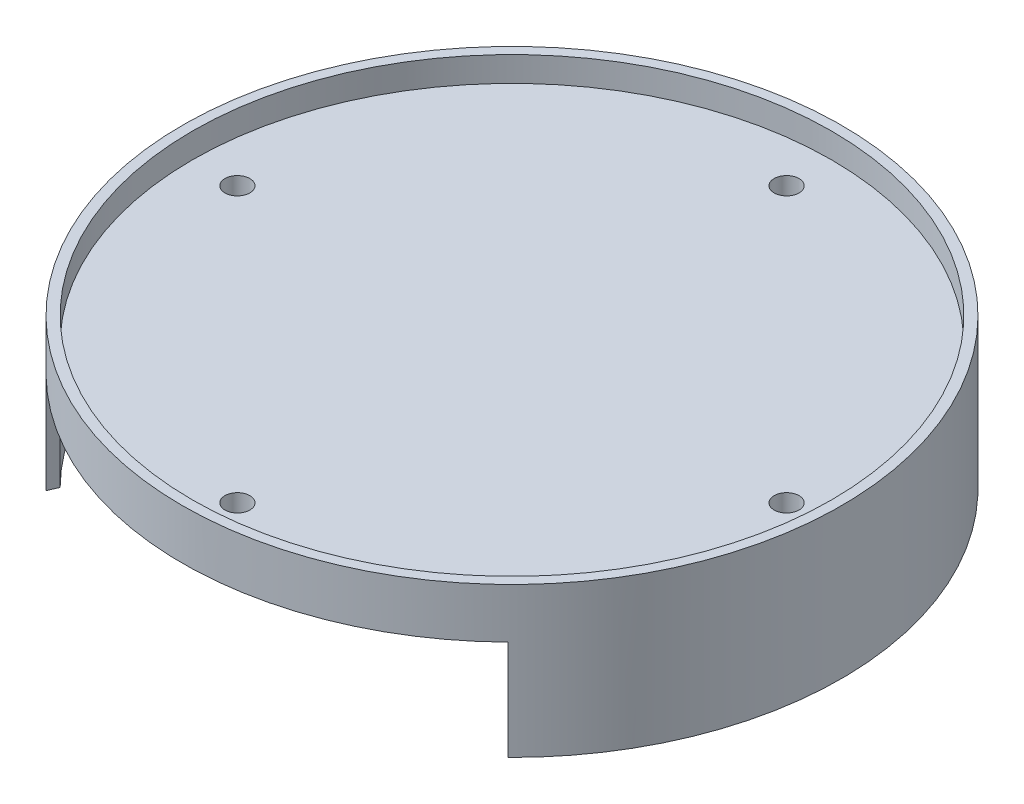
ISO-10303-21;
HEADER;
FILE_DESCRIPTION(('STEP AP214'),'2;1');
FILE_NAME('part.step','',(''),(''),'','','');
FILE_SCHEMA(('AUTOMOTIVE_DESIGN { 1 0 10303 214 1 1 1 1 }'));
ENDSEC;
DATA;
#1=APPLICATION_CONTEXT('core data for automotive mechanical design processes');
#2=APPLICATION_PROTOCOL_DEFINITION('international standard','automotive_design',2000,#1);
#3=PRODUCT_CONTEXT('',#1,'mechanical');
#4=PRODUCT('Part','Part','',(#3));
#5=PRODUCT_RELATED_PRODUCT_CATEGORY('part','',(#4));
#6=PRODUCT_DEFINITION_FORMATION('','',#4);
#7=PRODUCT_DEFINITION_CONTEXT('part definition',#1,'design');
#8=PRODUCT_DEFINITION('design','',#6,#7);
#9=PRODUCT_DEFINITION_SHAPE('','',#8);
#10=(LENGTH_UNIT() NAMED_UNIT(*) SI_UNIT(.MILLI.,.METRE.));
#11=(NAMED_UNIT(*) PLANE_ANGLE_UNIT() SI_UNIT($,.RADIAN.));
#12=(NAMED_UNIT(*) SI_UNIT($,.STERADIAN.) SOLID_ANGLE_UNIT());
#13=UNCERTAINTY_MEASURE_WITH_UNIT(LENGTH_MEASURE(1.E-05),#10,'distance_accuracy_value','');
#14=(GEOMETRIC_REPRESENTATION_CONTEXT(3) GLOBAL_UNCERTAINTY_ASSIGNED_CONTEXT((#13)) GLOBAL_UNIT_ASSIGNED_CONTEXT((#10,
#11,#12)) REPRESENTATION_CONTEXT('',''));
#15=CARTESIAN_POINT('',(0.,0.,0.));
#16=DIRECTION('',(0.,0.,1.));
#17=DIRECTION('',(1.,0.,0.));
#18=AXIS2_PLACEMENT_3D('',#15,#16,#17);
#19=CARTESIAN_POINT('',(0.,12.5,0.));
#20=DIRECTION('',(0.,1.,0.));
#21=DIRECTION('',(0.,0.,1.));
#22=AXIS2_PLACEMENT_3D('',#19,#20,#21);
#23=PLANE('',#22);
#24=CARTESIAN_POINT('',(-27.4999999999992,12.5,7.79913119987283E-13));
#25=DIRECTION('',(0.,1.,0.));
#26=DIRECTION('',(0.,0.,1.));
#27=AXIS2_PLACEMENT_3D('',#24,#25,#26);
#28=CIRCLE('',#27,1.25000000000125);
#29=CARTESIAN_POINT('',(-27.4999999999992,12.5,1.25000000000203));
#30=VERTEX_POINT('',#29);
#31=EDGE_CURVE('E118',#30,#30,#28,.T.);
#32=ORIENTED_EDGE('',*,*,#31,.F.);
#33=EDGE_LOOP('',(#32));
#34=FACE_BOUND('',#33,.T.);
#35=CARTESIAN_POINT('',(27.5,12.5,0.));
#36=DIRECTION('',(0.,1.,0.));
#37=DIRECTION('',(0.,0.,1.));
#38=AXIS2_PLACEMENT_3D('',#35,#36,#37);
#39=CIRCLE('',#38,1.25);
#40=CARTESIAN_POINT('',(27.5,12.5,1.2500000000001));
#41=VERTEX_POINT('',#40);
#42=EDGE_CURVE('E124',#41,#41,#39,.T.);
#43=ORIENTED_EDGE('',*,*,#42,.F.);
#44=EDGE_LOOP('',(#43));
#45=FACE_BOUND('',#44,.T.);
#46=CARTESIAN_POINT('',(0.,12.5,-27.5));
#47=DIRECTION('',(0.,1.,0.));
#48=DIRECTION('',(0.,0.,1.));
#49=AXIS2_PLACEMENT_3D('',#46,#47,#48);
#50=CIRCLE('',#49,1.25);
#51=CARTESIAN_POINT('',(0.,12.5,-26.25));
#52=VERTEX_POINT('',#51);
#53=EDGE_CURVE('E127',#52,#52,#50,.T.);
#54=ORIENTED_EDGE('',*,*,#53,.F.);
#55=EDGE_LOOP('',(#54));
#56=FACE_BOUND('',#55,.T.);
#57=CARTESIAN_POINT('',(1.55309068257925E-12,12.5,27.5));
#58=DIRECTION('',(0.,1.,0.));
#59=DIRECTION('',(0.,0.,1.));
#60=AXIS2_PLACEMENT_3D('',#57,#58,#59);
#61=CIRCLE('',#60,1.25000000000167);
#62=CARTESIAN_POINT('',(1.55309068257925E-12,12.5,28.7500000000017));
#63=VERTEX_POINT('',#62);
#64=EDGE_CURVE('E121',#63,#63,#61,.T.);
#65=ORIENTED_EDGE('',*,*,#64,.F.);
#66=EDGE_LOOP('',(#65));
#67=FACE_BOUND('',#66,.T.);
#68=CARTESIAN_POINT('',(0.,12.5,0.));
#69=DIRECTION('',(0.,1.,0.));
#70=DIRECTION('',(0.,0.,1.));
#71=AXIS2_PLACEMENT_3D('',#68,#69,#70);
#72=CIRCLE('',#71,32.);
#73=CARTESIAN_POINT('',(0.,12.5,32.));
#74=VERTEX_POINT('',#73);
#75=EDGE_CURVE('E11',#74,#74,#72,.F.);
#76=ORIENTED_EDGE('',*,*,#75,.F.);
#77=EDGE_LOOP('',(#76));
#78=FACE_BOUND('',#77,.T.);
#79=ADVANCED_FACE('F39',(#34,#45,#56,#67,#78),#23,.T.);
#80=CARTESIAN_POINT('',(0.,0.,0.));
#81=DIRECTION('',(0.,1.,0.));
#82=DIRECTION('',(0.,0.,1.));
#83=AXIS2_PLACEMENT_3D('',#80,#81,#82);
#84=PLANE('',#83);
#85=CARTESIAN_POINT('',(0.,0.,0.));
#86=DIRECTION('',(0.,1.,0.));
#87=DIRECTION('',(0.,0.,1.));
#88=AXIS2_PLACEMENT_3D('',#85,#86,#87);
#89=CIRCLE('',#88,33.);
#90=CARTESIAN_POINT('',(23.1370879607204,0.,23.530303030303));
#91=VERTEX_POINT('',#90);
#92=CARTESIAN_POINT('',(-23.1370879607204,0.,23.530303030303));
#93=VERTEX_POINT('',#92);
#94=EDGE_CURVE('E48',#91,#93,#89,.T.);
#95=ORIENTED_EDGE('',*,*,#94,.F.);
#96=CARTESIAN_POINT('',(0.,0.,33.));
#97=DIRECTION('',(0.,-1.,0.));
#98=DIRECTION('',(0.,0.,-1.));
#99=AXIS2_PLACEMENT_3D('',#96,#97,#98);
#100=CIRCLE('',#99,25.);
#101=CARTESIAN_POINT('',(22.7090836305396,0.,22.5454545454545));
#102=VERTEX_POINT('',#101);
#103=EDGE_CURVE('E99',#102,#91,#100,.T.);
#104=ORIENTED_EDGE('',*,*,#103,.F.);
#105=CARTESIAN_POINT('',(0.,0.,0.));
#106=DIRECTION('',(0.,1.,0.));
#107=DIRECTION('',(0.,0.,1.));
#108=AXIS2_PLACEMENT_3D('',#105,#106,#107);
#109=CIRCLE('',#108,32.);
#110=CARTESIAN_POINT('',(-22.7090836305396,0.,22.5454545454545));
#111=VERTEX_POINT('',#110);
#112=EDGE_CURVE('E97',#102,#111,#109,.T.);
#113=ORIENTED_EDGE('',*,*,#112,.T.);
#114=EDGE_CURVE('E63',#93,#111,#100,.T.);
#115=ORIENTED_EDGE('',*,*,#114,.F.);
#116=EDGE_LOOP('',(#95,#104,#113,#115));
#117=FACE_BOUND('',#116,.T.);
#118=ADVANCED_FACE('F136',(#117),#84,.F.);
#119=CARTESIAN_POINT('',(0.,12.5,0.));
#120=DIRECTION('',(0.,-1.,0.));
#121=DIRECTION('',(0.,0.,-1.));
#122=AXIS2_PLACEMENT_3D('',#119,#120,#121);
#123=CYLINDRICAL_SURFACE('',#122,33.);
#124=ORIENTED_EDGE('',*,*,#94,.T.);
#125=DIRECTION('',(0.,-1.,0.));
#126=VECTOR('',#125,1.);
#127=CARTESIAN_POINT('',(-23.1370879607204,5.,23.530303030303));
#128=LINE('',#127,#126);
#129=CARTESIAN_POINT('',(-23.1370879607204,10.,23.530303030303));
#130=VERTEX_POINT('',#129);
#131=EDGE_CURVE('E134',#93,#130,#128,.F.);
#132=ORIENTED_EDGE('',*,*,#131,.T.);
#133=CARTESIAN_POINT('',(0.,10.,0.));
#134=DIRECTION('',(0.,-1.,0.));
#135=DIRECTION('',(0.,0.,-1.));
#136=AXIS2_PLACEMENT_3D('',#133,#134,#135);
#137=CIRCLE('',#136,33.);
#138=CARTESIAN_POINT('',(23.1370879607204,10.,23.530303030303));
#139=VERTEX_POINT('',#138);
#140=EDGE_CURVE('E142',#139,#130,#137,.T.);
#141=ORIENTED_EDGE('',*,*,#140,.F.);
#142=DIRECTION('',(0.,-1.,0.));
#143=VECTOR('',#142,1.);
#144=CARTESIAN_POINT('',(23.1370879607204,5.,23.530303030303));
#145=LINE('',#144,#143);
#146=EDGE_CURVE('E88',#139,#91,#145,.T.);
#147=ORIENTED_EDGE('',*,*,#146,.T.);
#148=EDGE_LOOP('',(#124,#132,#141,#147));
#149=FACE_BOUND('',#148,.T.);
#150=CARTESIAN_POINT('',(0.,15.,0.));
#151=DIRECTION('',(0.,1.,0.));
#152=DIRECTION('',(0.,0.,1.));
#153=AXIS2_PLACEMENT_3D('',#150,#151,#152);
#154=CIRCLE('',#153,33.);
#155=CARTESIAN_POINT('',(0.,15.,33.));
#156=VERTEX_POINT('',#155);
#157=EDGE_CURVE('E106',#156,#156,#154,.T.);
#158=ORIENTED_EDGE('',*,*,#157,.F.);
#159=EDGE_LOOP('',(#158));
#160=FACE_BOUND('',#159,.T.);
#161=ADVANCED_FACE('F41',(#149,#160),#123,.T.);
#162=CARTESIAN_POINT('',(0.,12.5,-27.5));
#163=DIRECTION('',(0.,-1.,0.));
#164=DIRECTION('',(0.,0.,-1.));
#165=AXIS2_PLACEMENT_3D('',#162,#163,#164);
#166=CYLINDRICAL_SURFACE('',#165,1.25);
#167=CARTESIAN_POINT('',(0.,10.,-27.5));
#168=DIRECTION('',(0.,1.,0.));
#169=DIRECTION('',(0.,0.,1.));
#170=AXIS2_PLACEMENT_3D('',#167,#168,#169);
#171=CIRCLE('',#170,1.25);
#172=CARTESIAN_POINT('',(0.,10.,-26.25));
#173=VERTEX_POINT('',#172);
#174=EDGE_CURVE('E115',#173,#173,#171,.T.);
#175=ORIENTED_EDGE('',*,*,#174,.F.);
#176=EDGE_LOOP('',(#175));
#177=FACE_BOUND('',#176,.T.);
#178=ORIENTED_EDGE('',*,*,#53,.T.);
#179=EDGE_LOOP('',(#178));
#180=FACE_BOUND('',#179,.T.);
#181=ADVANCED_FACE('F152',(#177,#180),#166,.F.);
#182=CARTESIAN_POINT('',(27.5,12.5,0.));
#183=DIRECTION('',(0.,-1.,0.));
#184=DIRECTION('',(0.,0.,-1.));
#185=AXIS2_PLACEMENT_3D('',#182,#183,#184);
#186=CYLINDRICAL_SURFACE('',#185,1.25);
#187=CARTESIAN_POINT('',(27.5,10.,0.));
#188=DIRECTION('',(0.,1.,0.));
#189=DIRECTION('',(0.,0.,1.));
#190=AXIS2_PLACEMENT_3D('',#187,#188,#189);
#191=CIRCLE('',#190,1.25);
#192=CARTESIAN_POINT('',(27.5,10.,1.2500000000001));
#193=VERTEX_POINT('',#192);
#194=EDGE_CURVE('E112',#193,#193,#191,.T.);
#195=ORIENTED_EDGE('',*,*,#194,.F.);
#196=EDGE_LOOP('',(#195));
#197=FACE_BOUND('',#196,.T.);
#198=ORIENTED_EDGE('',*,*,#42,.T.);
#199=EDGE_LOOP('',(#198));
#200=FACE_BOUND('',#199,.T.);
#201=ADVANCED_FACE('F157',(#197,#200),#186,.F.);
#202=CARTESIAN_POINT('',(1.55309068257925E-12,12.5,27.5));
#203=DIRECTION('',(0.,-1.,0.));
#204=DIRECTION('',(0.,0.,-1.));
#205=AXIS2_PLACEMENT_3D('',#202,#203,#204);
#206=CYLINDRICAL_SURFACE('',#205,1.25000000000167);
#207=CARTESIAN_POINT('',(1.55309068257925E-12,10.,27.5));
#208=DIRECTION('',(0.,1.,0.));
#209=DIRECTION('',(0.,0.,1.));
#210=AXIS2_PLACEMENT_3D('',#207,#208,#209);
#211=CIRCLE('',#210,1.25000000000167);
#212=CARTESIAN_POINT('',(1.55309068257925E-12,10.,28.7500000000017));
#213=VERTEX_POINT('',#212);
#214=EDGE_CURVE('E105',#213,#213,#211,.T.);
#215=ORIENTED_EDGE('',*,*,#214,.F.);
#216=EDGE_LOOP('',(#215));
#217=FACE_BOUND('',#216,.T.);
#218=ORIENTED_EDGE('',*,*,#64,.T.);
#219=EDGE_LOOP('',(#218));
#220=FACE_BOUND('',#219,.T.);
#221=ADVANCED_FACE('F170',(#217,#220),#206,.F.);
#222=CARTESIAN_POINT('',(-27.4999999999992,12.5,7.79913119987283E-13));
#223=DIRECTION('',(0.,-1.,0.));
#224=DIRECTION('',(0.,0.,-1.));
#225=AXIS2_PLACEMENT_3D('',#222,#223,#224);
#226=CYLINDRICAL_SURFACE('',#225,1.25000000000125);
#227=CARTESIAN_POINT('',(-27.4999999999992,10.,7.79913119987283E-13));
#228=DIRECTION('',(0.,1.,0.));
#229=DIRECTION('',(0.,0.,1.));
#230=AXIS2_PLACEMENT_3D('',#227,#228,#229);
#231=CIRCLE('',#230,1.25000000000125);
#232=CARTESIAN_POINT('',(-27.4999999999992,10.,1.25000000000203));
#233=VERTEX_POINT('',#232);
#234=EDGE_CURVE('E43',#233,#233,#231,.T.);
#235=ORIENTED_EDGE('',*,*,#234,.F.);
#236=EDGE_LOOP('',(#235));
#237=FACE_BOUND('',#236,.T.);
#238=ORIENTED_EDGE('',*,*,#31,.T.);
#239=EDGE_LOOP('',(#238));
#240=FACE_BOUND('',#239,.T.);
#241=ADVANCED_FACE('F174',(#237,#240),#226,.F.);
#242=CARTESIAN_POINT('',(0.,10.,0.));
#243=DIRECTION('',(0.,-1.,0.));
#244=DIRECTION('',(0.,0.,-1.));
#245=AXIS2_PLACEMENT_3D('',#242,#243,#244);
#246=CYLINDRICAL_SURFACE('',#245,32.);
#247=DIRECTION('',(0.,-1.,0.));
#248=VECTOR('',#247,1.);
#249=CARTESIAN_POINT('',(-22.7090836305396,5.,22.5454545454545));
#250=LINE('',#249,#248);
#251=CARTESIAN_POINT('',(-22.7090836305396,10.,22.5454545454545));
#252=VERTEX_POINT('',#251);
#253=EDGE_CURVE('E98',#111,#252,#250,.F.);
#254=ORIENTED_EDGE('',*,*,#253,.F.);
#255=ORIENTED_EDGE('',*,*,#112,.F.);
#256=DIRECTION('',(0.,-1.,0.));
#257=VECTOR('',#256,1.);
#258=CARTESIAN_POINT('',(22.7090836305396,5.,22.5454545454545));
#259=LINE('',#258,#257);
#260=CARTESIAN_POINT('',(22.7090836305396,10.,22.5454545454545));
#261=VERTEX_POINT('',#260);
#262=EDGE_CURVE('E85',#261,#102,#259,.T.);
#263=ORIENTED_EDGE('',*,*,#262,.F.);
#264=CARTESIAN_POINT('',(0.,10.,0.));
#265=DIRECTION('',(0.,1.,0.));
#266=DIRECTION('',(0.,0.,1.));
#267=AXIS2_PLACEMENT_3D('',#264,#265,#266);
#268=CIRCLE('',#267,32.);
#269=EDGE_CURVE('E95',#261,#252,#268,.T.);
#270=ORIENTED_EDGE('',*,*,#269,.T.);
#271=EDGE_LOOP('',(#254,#255,#263,#270));
#272=FACE_BOUND('',#271,.T.);
#273=ADVANCED_FACE('F94',(#272),#246,.F.);
#274=CARTESIAN_POINT('',(0.,10.,0.));
#275=DIRECTION('',(0.,1.,0.));
#276=DIRECTION('',(0.,0.,1.));
#277=AXIS2_PLACEMENT_3D('',#274,#275,#276);
#278=PLANE('',#277);
#279=ORIENTED_EDGE('',*,*,#174,.T.);
#280=EDGE_LOOP('',(#279));
#281=FACE_BOUND('',#280,.T.);
#282=ORIENTED_EDGE('',*,*,#194,.T.);
#283=EDGE_LOOP('',(#282));
#284=FACE_BOUND('',#283,.T.);
#285=ORIENTED_EDGE('',*,*,#234,.T.);
#286=EDGE_LOOP('',(#285));
#287=FACE_BOUND('',#286,.T.);
#288=ORIENTED_EDGE('',*,*,#269,.F.);
#289=CARTESIAN_POINT('',(0.,10.,33.));
#290=DIRECTION('',(0.,-1.,0.));
#291=DIRECTION('',(0.,0.,-1.));
#292=AXIS2_PLACEMENT_3D('',#289,#290,#291);
#293=CIRCLE('',#292,25.);
#294=EDGE_CURVE('E82',#261,#139,#293,.T.);
#295=ORIENTED_EDGE('',*,*,#294,.T.);
#296=ORIENTED_EDGE('',*,*,#140,.T.);
#297=EDGE_CURVE('E56',#130,#252,#293,.T.);
#298=ORIENTED_EDGE('',*,*,#297,.T.);
#299=EDGE_LOOP('',(#288,#295,#296,#298));
#300=FACE_BOUND('',#299,.T.);
#301=ORIENTED_EDGE('',*,*,#214,.T.);
#302=EDGE_LOOP('',(#301));
#303=FACE_BOUND('',#302,.T.);
#304=ADVANCED_FACE('F101',(#281,#284,#287,#300,#303),#278,.F.);
#305=CARTESIAN_POINT('',(0.,15.,0.));
#306=DIRECTION('',(0.,1.,0.));
#307=DIRECTION('',(0.,0.,1.));
#308=AXIS2_PLACEMENT_3D('',#305,#306,#307);
#309=PLANE('',#308);
#310=ORIENTED_EDGE('',*,*,#157,.T.);
#311=EDGE_LOOP('',(#310));
#312=FACE_BOUND('',#311,.T.);
#313=CARTESIAN_POINT('',(0.,15.,0.));
#314=DIRECTION('',(0.,1.,0.));
#315=DIRECTION('',(0.,0.,1.));
#316=AXIS2_PLACEMENT_3D('',#313,#314,#315);
#317=CIRCLE('',#316,32.);
#318=CARTESIAN_POINT('',(0.,15.,32.));
#319=VERTEX_POINT('',#318);
#320=EDGE_CURVE('E144',#319,#319,#317,.T.);
#321=ORIENTED_EDGE('',*,*,#320,.F.);
#322=EDGE_LOOP('',(#321));
#323=FACE_BOUND('',#322,.T.);
#324=ADVANCED_FACE('F149',(#312,#323),#309,.T.);
#325=CARTESIAN_POINT('',(0.,15.,0.));
#326=DIRECTION('',(0.,-1.,0.));
#327=DIRECTION('',(0.,0.,-1.));
#328=AXIS2_PLACEMENT_3D('',#325,#326,#327);
#329=CYLINDRICAL_SURFACE('',#328,32.);
#330=ORIENTED_EDGE('',*,*,#75,.T.);
#331=EDGE_LOOP('',(#330));
#332=FACE_BOUND('',#331,.T.);
#333=ORIENTED_EDGE('',*,*,#320,.T.);
#334=EDGE_LOOP('',(#333));
#335=FACE_BOUND('',#334,.T.);
#336=ADVANCED_FACE('F186',(#332,#335),#329,.F.);
#337=CARTESIAN_POINT('',(0.,0.,33.));
#338=DIRECTION('',(0.,-1.,0.));
#339=DIRECTION('',(0.,0.,-1.));
#340=AXIS2_PLACEMENT_3D('',#337,#338,#339);
#341=CYLINDRICAL_SURFACE('',#340,25.);
#342=ORIENTED_EDGE('',*,*,#114,.T.);
#343=ORIENTED_EDGE('',*,*,#253,.T.);
#344=ORIENTED_EDGE('',*,*,#297,.F.);
#345=ORIENTED_EDGE('',*,*,#131,.F.);
#346=EDGE_LOOP('',(#342,#343,#344,#345));
#347=FACE_BOUND('',#346,.T.);
#348=ADVANCED_FACE('F189',(#347),#341,.F.);
#349=ORIENTED_EDGE('',*,*,#294,.F.);
#350=ORIENTED_EDGE('',*,*,#262,.T.);
#351=ORIENTED_EDGE('',*,*,#103,.T.);
#352=ORIENTED_EDGE('',*,*,#146,.F.);
#353=EDGE_LOOP('',(#349,#350,#351,#352));
#354=FACE_BOUND('',#353,.T.);
#355=ADVANCED_FACE('F84',(#354),#341,.F.);
#356=CLOSED_SHELL('',(#79,#118,#161,#181,#201,#221,#241,#273,#304,#324,#336,#348,#355));
#357=MANIFOLD_SOLID_BREP('B2',#356);
#358=ADVANCED_BREP_SHAPE_REPRESENTATION('',(#18,#357),#14);
#359=SHAPE_DEFINITION_REPRESENTATION(#9,#358);
ENDSEC;
END-ISO-10303-21;
